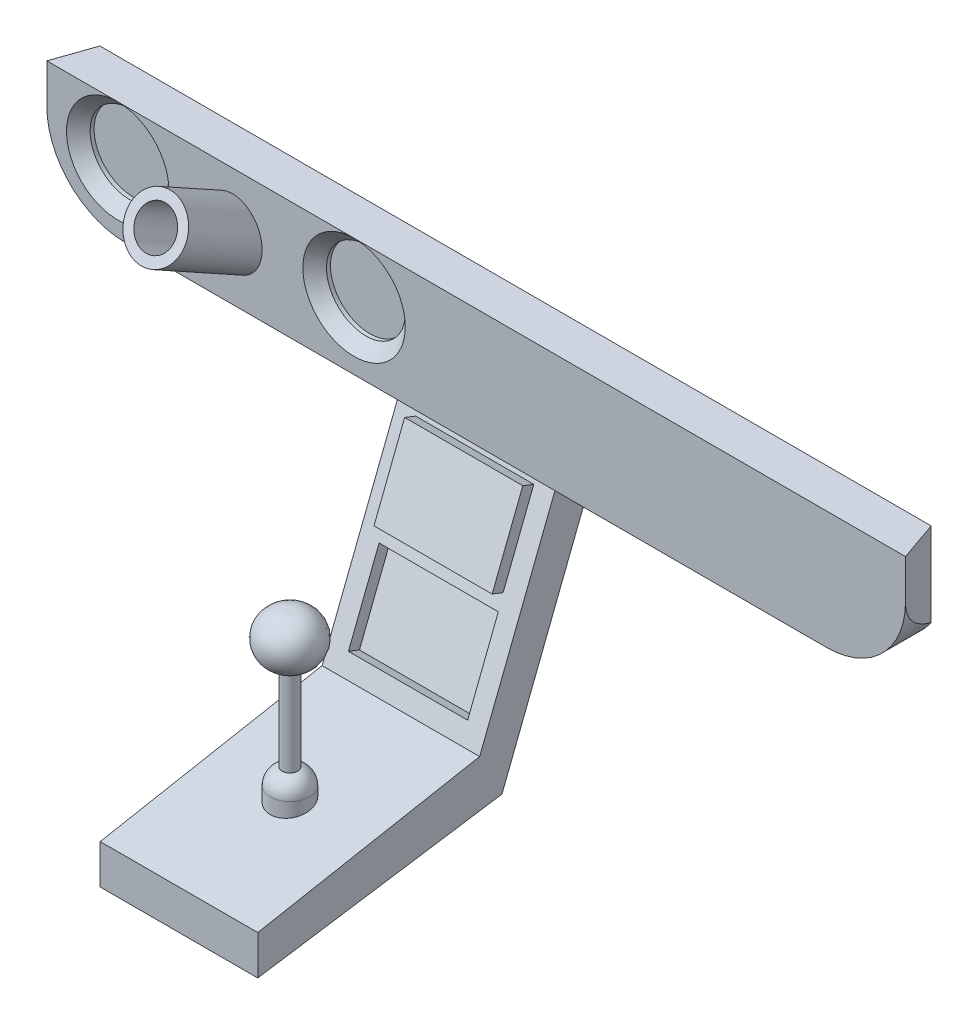
ISO-10303-21;
HEADER;
FILE_DESCRIPTION(('STEP AP214'),'2;1');
FILE_NAME('part.step','',(''),(''),'','','');
FILE_SCHEMA(('AUTOMOTIVE_DESIGN { 1 0 10303 214 1 1 1 1 }'));
ENDSEC;
DATA;
#1=APPLICATION_CONTEXT('core data for automotive mechanical design processes');
#2=APPLICATION_PROTOCOL_DEFINITION('international standard','automotive_design',2000,#1);
#3=PRODUCT_CONTEXT('',#1,'mechanical');
#4=PRODUCT('Part','Part','',(#3));
#5=PRODUCT_RELATED_PRODUCT_CATEGORY('part','',(#4));
#6=PRODUCT_DEFINITION_FORMATION('','',#4);
#7=PRODUCT_DEFINITION_CONTEXT('part definition',#1,'design');
#8=PRODUCT_DEFINITION('design','',#6,#7);
#9=PRODUCT_DEFINITION_SHAPE('','',#8);
#10=(LENGTH_UNIT() NAMED_UNIT(*) SI_UNIT(.MILLI.,.METRE.));
#11=(NAMED_UNIT(*) PLANE_ANGLE_UNIT() SI_UNIT($,.RADIAN.));
#12=(NAMED_UNIT(*) SI_UNIT($,.STERADIAN.) SOLID_ANGLE_UNIT());
#13=UNCERTAINTY_MEASURE_WITH_UNIT(LENGTH_MEASURE(1.E-05),#10,'distance_accuracy_value','');
#14=(GEOMETRIC_REPRESENTATION_CONTEXT(3) GLOBAL_UNCERTAINTY_ASSIGNED_CONTEXT((#13)) GLOBAL_UNIT_ASSIGNED_CONTEXT((#10,
#11,#12)) REPRESENTATION_CONTEXT('',''));
#15=CARTESIAN_POINT('',(0.,0.,0.));
#16=DIRECTION('',(0.,0.,1.));
#17=DIRECTION('',(1.,0.,0.));
#18=AXIS2_PLACEMENT_3D('',#15,#16,#17);
#19=CARTESIAN_POINT('',(-109.,-15.,5.));
#20=DIRECTION('',(0.,1.,0.));
#21=DIRECTION('',(0.,0.,1.));
#22=AXIS2_PLACEMENT_3D('',#19,#20,#21);
#23=PLANE('',#22);
#24=DIRECTION('',(0.,0.,1.));
#25=VECTOR('',#24,1.);
#26=CARTESIAN_POINT('',(20.,-15.,-5.));
#27=LINE('',#26,#25);
#28=CARTESIAN_POINT('',(20.,-15.,-5.));
#29=VERTEX_POINT('',#28);
#30=CARTESIAN_POINT('',(20.,-15.,5.));
#31=VERTEX_POINT('',#30);
#32=EDGE_CURVE('E337',#29,#31,#27,.T.);
#33=ORIENTED_EDGE('',*,*,#32,.F.);
#34=DIRECTION('',(1.,0.,0.));
#35=VECTOR('',#34,1.);
#36=CARTESIAN_POINT('',(-109.,-15.,-5.));
#37=LINE('',#36,#35);
#38=CARTESIAN_POINT('',(89.,-15.,-5.));
#39=VERTEX_POINT('',#38);
#40=EDGE_CURVE('E207',#29,#39,#37,.T.);
#41=ORIENTED_EDGE('',*,*,#40,.T.);
#42=DIRECTION('',(0.,0.,-1.));
#43=VECTOR('',#42,1.);
#44=CARTESIAN_POINT('',(89.,-15.,5.));
#45=LINE('',#44,#43);
#46=CARTESIAN_POINT('',(89.,-15.,5.));
#47=VERTEX_POINT('',#46);
#48=EDGE_CURVE('E229',#39,#47,#45,.F.);
#49=ORIENTED_EDGE('',*,*,#48,.T.);
#50=DIRECTION('',(1.,0.,0.));
#51=VECTOR('',#50,1.);
#52=CARTESIAN_POINT('',(-109.,-15.,5.));
#53=LINE('',#52,#51);
#54=EDGE_CURVE('E396',#31,#47,#53,.T.);
#55=ORIENTED_EDGE('',*,*,#54,.F.);
#56=EDGE_LOOP('',(#33,#41,#49,#55));
#57=FACE_BOUND('',#56,.T.);
#58=ADVANCED_FACE('F34',(#57),#23,.F.);
#59=CARTESIAN_POINT('',(-109.,15.,5.));
#60=DIRECTION('',(0.,-1.,0.));
#61=DIRECTION('',(0.,0.,-1.));
#62=AXIS2_PLACEMENT_3D('',#59,#60,#61);
#63=PLANE('',#62);
#64=DIRECTION('',(-1.,0.,0.));
#65=VECTOR('',#64,1.);
#66=CARTESIAN_POINT('',(-109.,15.,5.));
#67=LINE('',#66,#65);
#68=CARTESIAN_POINT('',(109.,15.,5.));
#69=VERTEX_POINT('',#68);
#70=CARTESIAN_POINT('',(-31.,15.,5.));
#71=VERTEX_POINT('',#70);
#72=EDGE_CURVE('E203',#69,#71,#67,.T.);
#73=ORIENTED_EDGE('',*,*,#72,.F.);
#74=DIRECTION('',(0.328667145466067,0.,0.94444582030479));
#75=VECTOR('',#74,1.);
#76=CARTESIAN_POINT('',(105.52,15.,-5.));
#77=LINE('',#76,#75);
#78=CARTESIAN_POINT('',(105.52,15.,-5.));
#79=VERTEX_POINT('',#78);
#80=EDGE_CURVE('E188',#79,#69,#77,.T.);
#81=ORIENTED_EDGE('',*,*,#80,.F.);
#82=DIRECTION('',(-1.,0.,0.));
#83=VECTOR('',#82,1.);
#84=CARTESIAN_POINT('',(-109.,15.,-5.));
#85=LINE('',#84,#83);
#86=CARTESIAN_POINT('',(-105.52,15.,-5.));
#87=VERTEX_POINT('',#86);
#88=EDGE_CURVE('E200',#79,#87,#85,.T.);
#89=ORIENTED_EDGE('',*,*,#88,.T.);
#90=DIRECTION('',(0.328667145466067,0.,-0.94444582030479));
#91=VECTOR('',#90,1.);
#92=CARTESIAN_POINT('',(-109.,15.,5.));
#93=LINE('',#92,#91);
#94=CARTESIAN_POINT('',(-109.,15.,5.));
#95=VERTEX_POINT('',#94);
#96=EDGE_CURVE('E194',#95,#87,#93,.T.);
#97=ORIENTED_EDGE('',*,*,#96,.F.);
#98=CARTESIAN_POINT('',(-91.,15.,5.));
#99=VERTEX_POINT('',#98);
#100=EDGE_CURVE('E393',#99,#95,#67,.T.);
#101=ORIENTED_EDGE('',*,*,#100,.F.);
#102=EDGE_CURVE('E395',#71,#99,#67,.T.);
#103=ORIENTED_EDGE('',*,*,#102,.F.);
#104=EDGE_LOOP('',(#73,#81,#89,#97,#101,#103));
#105=FACE_BOUND('',#104,.T.);
#106=ADVANCED_FACE('F198',(#105),#63,.F.);
#107=CARTESIAN_POINT('',(-89.,-15.,-5.));
#108=VERTEX_POINT('',#107);
#109=CARTESIAN_POINT('',(-20.,-15.,-5.));
#110=VERTEX_POINT('',#109);
#111=EDGE_CURVE('E211',#108,#110,#37,.T.);
#112=ORIENTED_EDGE('',*,*,#111,.T.);
#113=DIRECTION('',(0.,0.,1.));
#114=VECTOR('',#113,1.);
#115=CARTESIAN_POINT('',(-20.,-15.,-5.));
#116=LINE('',#115,#114);
#117=CARTESIAN_POINT('',(-20.,-15.,5.));
#118=VERTEX_POINT('',#117);
#119=EDGE_CURVE('E352',#110,#118,#116,.T.);
#120=ORIENTED_EDGE('',*,*,#119,.T.);
#121=CARTESIAN_POINT('',(-89.,-15.,5.));
#122=VERTEX_POINT('',#121);
#123=EDGE_CURVE('E217',#122,#118,#53,.T.);
#124=ORIENTED_EDGE('',*,*,#123,.F.);
#125=DIRECTION('',(0.,0.,-1.));
#126=VECTOR('',#125,1.);
#127=CARTESIAN_POINT('',(-89.,-15.,5.));
#128=LINE('',#127,#126);
#129=EDGE_CURVE('E226',#122,#108,#128,.T.);
#130=ORIENTED_EDGE('',*,*,#129,.T.);
#131=EDGE_LOOP('',(#112,#120,#124,#130));
#132=FACE_BOUND('',#131,.T.);
#133=ADVANCED_FACE('F464',(#132),#23,.F.);
#134=CARTESIAN_POINT('',(0.,0.,5.));
#135=DIRECTION('',(0.,0.,1.));
#136=DIRECTION('',(1.,0.,0.));
#137=AXIS2_PLACEMENT_3D('',#134,#135,#136);
#138=PLANE('',#137);
#139=CARTESIAN_POINT('',(-61.85,0.770482043936028,5.));
#140=DIRECTION('',(0.,0.,1.));
#141=DIRECTION('',(0.,1.,0.));
#142=AXIS2_PLACEMENT_3D('',#139,#140,#141);
#143=ELLIPSE('',#142,8.57438243843176,7.50000000000001);
#144=CARTESIAN_POINT('',(-61.85,9.34486448236779,5.));
#145=VERTEX_POINT('',#144);
#146=EDGE_CURVE('E249',#145,#145,#143,.T.);
#147=ORIENTED_EDGE('',*,*,#146,.F.);
#148=EDGE_LOOP('',(#147));
#149=FACE_BOUND('',#148,.T.);
#150=ORIENTED_EDGE('',*,*,#72,.T.);
#151=CARTESIAN_POINT('',(-31.,2.,5.));
#152=DIRECTION('',(0.,0.,1.));
#153=DIRECTION('',(1.,0.,0.));
#154=AXIS2_PLACEMENT_3D('',#151,#152,#153);
#155=CIRCLE('',#154,13.);
#156=EDGE_CURVE('E243',#71,#71,#155,.F.);
#157=ORIENTED_EDGE('',*,*,#156,.T.);
#158=ORIENTED_EDGE('',*,*,#102,.T.);
#159=CARTESIAN_POINT('',(-91.,2.,5.));
#160=DIRECTION('',(0.,0.,1.));
#161=DIRECTION('',(1.,0.,0.));
#162=AXIS2_PLACEMENT_3D('',#159,#160,#161);
#163=CIRCLE('',#162,13.);
#164=EDGE_CURVE('E240',#99,#99,#163,.F.);
#165=ORIENTED_EDGE('',*,*,#164,.T.);
#166=ORIENTED_EDGE('',*,*,#100,.T.);
#167=DIRECTION('',(0.,-1.,0.));
#168=VECTOR('',#167,1.);
#169=CARTESIAN_POINT('',(-109.,15.,5.));
#170=LINE('',#169,#168);
#171=CARTESIAN_POINT('',(-109.,5.,5.));
#172=VERTEX_POINT('',#171);
#173=EDGE_CURVE('E394',#95,#172,#170,.T.);
#174=ORIENTED_EDGE('',*,*,#173,.T.);
#175=CARTESIAN_POINT('',(-89.,5.,5.));
#176=DIRECTION('',(0.,0.,1.));
#177=DIRECTION('',(1.,0.,0.));
#178=AXIS2_PLACEMENT_3D('',#175,#176,#177);
#179=CIRCLE('',#178,20.);
#180=EDGE_CURVE('E232',#172,#122,#179,.T.);
#181=ORIENTED_EDGE('',*,*,#180,.T.);
#182=ORIENTED_EDGE('',*,*,#123,.T.);
#183=DIRECTION('',(-1.,0.,0.));
#184=VECTOR('',#183,1.);
#185=CARTESIAN_POINT('',(20.,-15.,5.));
#186=LINE('',#185,#184);
#187=EDGE_CURVE('E372',#31,#118,#186,.T.);
#188=ORIENTED_EDGE('',*,*,#187,.F.);
#189=ORIENTED_EDGE('',*,*,#54,.T.);
#190=CARTESIAN_POINT('',(89.,5.,5.));
#191=DIRECTION('',(0.,0.,1.));
#192=DIRECTION('',(1.,0.,0.));
#193=AXIS2_PLACEMENT_3D('',#190,#191,#192);
#194=CIRCLE('',#193,20.);
#195=CARTESIAN_POINT('',(109.,5.,5.));
#196=VERTEX_POINT('',#195);
#197=EDGE_CURVE('E234',#47,#196,#194,.T.);
#198=ORIENTED_EDGE('',*,*,#197,.T.);
#199=DIRECTION('',(0.,1.,0.));
#200=VECTOR('',#199,1.);
#201=CARTESIAN_POINT('',(109.,15.,5.));
#202=LINE('',#201,#200);
#203=EDGE_CURVE('E221',#196,#69,#202,.T.);
#204=ORIENTED_EDGE('',*,*,#203,.T.);
#205=EDGE_LOOP('',(#150,#157,#158,#165,#166,#174,#181,#182,#188,#189,#198,#204));
#206=FACE_BOUND('',#205,.T.);
#207=ADVANCED_FACE('F403',(#149,#206),#138,.T.);
#208=CARTESIAN_POINT('',(0.,0.,-5.));
#209=DIRECTION('',(0.,0.,1.));
#210=DIRECTION('',(1.,0.,0.));
#211=AXIS2_PLACEMENT_3D('',#208,#209,#210);
#212=PLANE('',#211);
#213=CARTESIAN_POINT('',(-61.85,-4.77048204393603,-5.));
#214=DIRECTION('',(0.,0.,1.));
#215=DIRECTION('',(0.,1.,0.));
#216=AXIS2_PLACEMENT_3D('',#213,#214,#215);
#217=ELLIPSE('',#216,8.57438243843176,7.50000000000001);
#218=CARTESIAN_POINT('',(-61.85,3.80390039449573,-5.));
#219=VERTEX_POINT('',#218);
#220=EDGE_CURVE('E250',#219,#219,#217,.T.);
#221=ORIENTED_EDGE('',*,*,#220,.T.);
#222=EDGE_LOOP('',(#221));
#223=FACE_BOUND('',#222,.T.);
#224=ORIENTED_EDGE('',*,*,#88,.F.);
#225=DIRECTION('',(0.,1.,0.));
#226=VECTOR('',#225,1.);
#227=CARTESIAN_POINT('',(105.52,-25.,-5.));
#228=LINE('',#227,#226);
#229=CARTESIAN_POINT('',(105.52,-6.27340232582869,-5.));
#230=VERTEX_POINT('',#229);
#231=EDGE_CURVE('E185',#230,#79,#228,.T.);
#232=ORIENTED_EDGE('',*,*,#231,.F.);
#233=CARTESIAN_POINT('',(89.,5.,-5.));
#234=DIRECTION('',(0.,0.,1.));
#235=DIRECTION('',(1.,0.,0.));
#236=AXIS2_PLACEMENT_3D('',#233,#234,#235);
#237=CIRCLE('',#236,20.);
#238=EDGE_CURVE('E224',#230,#39,#237,.F.);
#239=ORIENTED_EDGE('',*,*,#238,.T.);
#240=ORIENTED_EDGE('',*,*,#40,.F.);
#241=DIRECTION('',(-1.,0.,0.));
#242=VECTOR('',#241,1.);
#243=CARTESIAN_POINT('',(20.,-15.,-5.));
#244=LINE('',#243,#242);
#245=EDGE_CURVE('E375',#29,#110,#244,.T.);
#246=ORIENTED_EDGE('',*,*,#245,.T.);
#247=ORIENTED_EDGE('',*,*,#111,.F.);
#248=CARTESIAN_POINT('',(-89.,5.,-5.));
#249=DIRECTION('',(0.,0.,1.));
#250=DIRECTION('',(1.,0.,0.));
#251=AXIS2_PLACEMENT_3D('',#248,#249,#250);
#252=CIRCLE('',#251,20.);
#253=CARTESIAN_POINT('',(-105.52,-6.27340232582869,-5.));
#254=VERTEX_POINT('',#253);
#255=EDGE_CURVE('E222',#108,#254,#252,.F.);
#256=ORIENTED_EDGE('',*,*,#255,.T.);
#257=DIRECTION('',(0.,1.,0.));
#258=VECTOR('',#257,1.);
#259=CARTESIAN_POINT('',(-105.52,-25.,-5.));
#260=LINE('',#259,#258);
#261=EDGE_CURVE('E49',#254,#87,#260,.T.);
#262=ORIENTED_EDGE('',*,*,#261,.T.);
#263=EDGE_LOOP('',(#224,#232,#239,#240,#246,#247,#256,#262));
#264=FACE_BOUND('',#263,.T.);
#265=ADVANCED_FACE('F205',(#223,#264),#212,.F.);
#266=CARTESIAN_POINT('',(89.,5.,5.));
#267=DIRECTION('',(0.,0.,-1.));
#268=DIRECTION('',(-1.,0.,0.));
#269=AXIS2_PLACEMENT_3D('',#266,#267,#268);
#270=CYLINDRICAL_SURFACE('',#269,20.);
#271=CARTESIAN_POINT('',(89.,5.,-52.4712643678162));
#272=DIRECTION('',(-0.94444582030479,0.,0.328667145466067));
#273=DIRECTION('',(-0.328667145466067,0.,-0.94444582030479));
#274=AXIS2_PLACEMENT_3D('',#271,#272,#273);
#275=ELLIPSE('',#274,60.8518383291369,20.);
#276=EDGE_CURVE('E11',#196,#230,#275,.F.);
#277=ORIENTED_EDGE('',*,*,#276,.F.);
#278=ORIENTED_EDGE('',*,*,#197,.F.);
#279=ORIENTED_EDGE('',*,*,#48,.F.);
#280=ORIENTED_EDGE('',*,*,#238,.F.);
#281=EDGE_LOOP('',(#277,#278,#279,#280));
#282=FACE_BOUND('',#281,.T.);
#283=ADVANCED_FACE('F437',(#282),#270,.T.);
#284=CARTESIAN_POINT('',(-89.,5.,5.));
#285=DIRECTION('',(0.,0.,-1.));
#286=DIRECTION('',(-1.,0.,0.));
#287=AXIS2_PLACEMENT_3D('',#284,#285,#286);
#288=CYLINDRICAL_SURFACE('',#287,20.);
#289=CARTESIAN_POINT('',(-89.,5.,-52.4712643678162));
#290=DIRECTION('',(0.94444582030479,0.,0.328667145466067));
#291=DIRECTION('',(0.328667145466067,0.,-0.94444582030479));
#292=AXIS2_PLACEMENT_3D('',#289,#290,#291);
#293=ELLIPSE('',#292,60.8518383291369,20.);
#294=EDGE_CURVE('E42',#254,#172,#293,.F.);
#295=ORIENTED_EDGE('',*,*,#294,.F.);
#296=ORIENTED_EDGE('',*,*,#255,.F.);
#297=ORIENTED_EDGE('',*,*,#129,.F.);
#298=ORIENTED_EDGE('',*,*,#180,.F.);
#299=EDGE_LOOP('',(#295,#296,#297,#298));
#300=FACE_BOUND('',#299,.T.);
#301=ADVANCED_FACE('F533',(#300),#288,.T.);
#302=CARTESIAN_POINT('',(-31.,2.,1.));
#303=DIRECTION('',(0.,0.,1.));
#304=DIRECTION('',(1.,0.,0.));
#305=AXIS2_PLACEMENT_3D('',#302,#303,#304);
#306=CYLINDRICAL_SURFACE('',#305,10.);
#307=CARTESIAN_POINT('',(-31.,2.,1.99999999999998));
#308=DIRECTION('',(0.,0.,1.));
#309=DIRECTION('',(1.,0.,0.));
#310=AXIS2_PLACEMENT_3D('',#307,#308,#309);
#311=CIRCLE('',#310,10.);
#312=CARTESIAN_POINT('',(-21.,2.,1.99999999999998));
#313=VERTEX_POINT('',#312);
#314=EDGE_CURVE('E237',#313,#313,#311,.T.);
#315=ORIENTED_EDGE('',*,*,#314,.T.);
#316=EDGE_LOOP('',(#315));
#317=FACE_BOUND('',#316,.T.);
#318=CARTESIAN_POINT('',(-31.,2.,1.));
#319=DIRECTION('',(0.,0.,1.));
#320=DIRECTION('',(1.,0.,0.));
#321=AXIS2_PLACEMENT_3D('',#318,#319,#320);
#322=CIRCLE('',#321,10.);
#323=CARTESIAN_POINT('',(-21.,2.,1.));
#324=VERTEX_POINT('',#323);
#325=EDGE_CURVE('E214',#324,#324,#322,.T.);
#326=ORIENTED_EDGE('',*,*,#325,.F.);
#327=EDGE_LOOP('',(#326));
#328=FACE_BOUND('',#327,.T.);
#329=ADVANCED_FACE('F536',(#317,#328),#306,.F.);
#330=CARTESIAN_POINT('',(-31.,2.,1.));
#331=DIRECTION('',(0.,0.,1.));
#332=DIRECTION('',(1.,0.,0.));
#333=AXIS2_PLACEMENT_3D('',#330,#331,#332);
#334=PLANE('',#333);
#335=ORIENTED_EDGE('',*,*,#325,.T.);
#336=EDGE_LOOP('',(#335));
#337=FACE_BOUND('',#336,.T.);
#338=ADVANCED_FACE('F452',(#337),#334,.T.);
#339=CARTESIAN_POINT('',(-91.,2.,1.));
#340=DIRECTION('',(0.,0.,1.));
#341=DIRECTION('',(1.,0.,0.));
#342=AXIS2_PLACEMENT_3D('',#339,#340,#341);
#343=CYLINDRICAL_SURFACE('',#342,9.99999999999999);
#344=CARTESIAN_POINT('',(-91.,2.,1.99999999999998));
#345=DIRECTION('',(0.,0.,1.));
#346=DIRECTION('',(1.,0.,0.));
#347=AXIS2_PLACEMENT_3D('',#344,#345,#346);
#348=CIRCLE('',#347,9.99999999999999);
#349=CARTESIAN_POINT('',(-81.,2.,1.99999999999998));
#350=VERTEX_POINT('',#349);
#351=EDGE_CURVE('E246',#350,#350,#348,.T.);
#352=ORIENTED_EDGE('',*,*,#351,.T.);
#353=EDGE_LOOP('',(#352));
#354=FACE_BOUND('',#353,.T.);
#355=CARTESIAN_POINT('',(-91.,2.,1.));
#356=DIRECTION('',(0.,0.,1.));
#357=DIRECTION('',(1.,0.,0.));
#358=AXIS2_PLACEMENT_3D('',#355,#356,#357);
#359=CIRCLE('',#358,9.99999999999999);
#360=CARTESIAN_POINT('',(-81.,2.,1.));
#361=VERTEX_POINT('',#360);
#362=EDGE_CURVE('E208',#361,#361,#359,.T.);
#363=ORIENTED_EDGE('',*,*,#362,.F.);
#364=EDGE_LOOP('',(#363));
#365=FACE_BOUND('',#364,.T.);
#366=ADVANCED_FACE('F448',(#354,#365),#343,.F.);
#367=CARTESIAN_POINT('',(-91.,2.,1.));
#368=DIRECTION('',(0.,0.,1.));
#369=DIRECTION('',(1.,0.,0.));
#370=AXIS2_PLACEMENT_3D('',#367,#368,#369);
#371=PLANE('',#370);
#372=ORIENTED_EDGE('',*,*,#362,.T.);
#373=EDGE_LOOP('',(#372));
#374=FACE_BOUND('',#373,.T.);
#375=ADVANCED_FACE('F451',(#374),#371,.T.);
#376=CARTESIAN_POINT('',(-31.,2.,1.99999999999998));
#377=DIRECTION('',(0.,0.,1.));
#378=DIRECTION('',(1.,0.,0.));
#379=AXIS2_PLACEMENT_3D('',#376,#377,#378);
#380=CONICAL_SURFACE('',#379,10.,0.785398163397452);
#381=ORIENTED_EDGE('',*,*,#156,.F.);
#382=EDGE_LOOP('',(#381));
#383=FACE_BOUND('',#382,.T.);
#384=ORIENTED_EDGE('',*,*,#314,.F.);
#385=EDGE_LOOP('',(#384));
#386=FACE_BOUND('',#385,.T.);
#387=ADVANCED_FACE('F445',(#383,#386),#380,.F.);
#388=CARTESIAN_POINT('',(-91.,2.,1.99999999999998));
#389=DIRECTION('',(0.,0.,1.));
#390=DIRECTION('',(1.,0.,0.));
#391=AXIS2_PLACEMENT_3D('',#388,#389,#390);
#392=CONICAL_SURFACE('',#391,9.99999999999999,0.785398163397452);
#393=ORIENTED_EDGE('',*,*,#164,.F.);
#394=EDGE_LOOP('',(#393));
#395=FACE_BOUND('',#394,.T.);
#396=ORIENTED_EDGE('',*,*,#351,.F.);
#397=EDGE_LOOP('',(#396));
#398=FACE_BOUND('',#397,.T.);
#399=ADVANCED_FACE('F36',(#395,#398),#392,.F.);
#400=CARTESIAN_POINT('',(-61.8499999999999,-13.3542745028374,-5.01698264114393));
#401=DIRECTION('',(0.,-0.484667332690623,-0.874698563290553));
#402=DIRECTION('',(0.,0.874698563290553,-0.484667332690623));
#403=AXIS2_PLACEMENT_3D('',#400,#401,#402);
#404=PLANE('',#403);
#405=CARTESIAN_POINT('',(-61.85,-6.79403527815822,-8.65198763632361));
#406=DIRECTION('',(0.,-0.484667332690623,-0.874698563290553));
#407=DIRECTION('',(0.,0.874698563290553,-0.484667332690623));
#408=AXIS2_PLACEMENT_3D('',#405,#406,#407);
#409=CIRCLE('',#408,5.);
#410=CARTESIAN_POINT('',(-61.85,-2.42054246170546,-11.0753242997767));
#411=VERTEX_POINT('',#410);
#412=EDGE_CURVE('E380',#411,#411,#409,.T.);
#413=ORIENTED_EDGE('',*,*,#412,.F.);
#414=EDGE_LOOP('',(#413));
#415=FACE_BOUND('',#414,.T.);
#416=CARTESIAN_POINT('',(-61.85,-6.79403527815822,-8.65198763632362));
#417=DIRECTION('',(0.,0.484667332690623,0.874698563290553));
#418=DIRECTION('',(0.,-0.874698563290553,0.484667332690623));
#419=AXIS2_PLACEMENT_3D('',#416,#417,#418);
#420=CIRCLE('',#419,7.50000000000001);
#421=CARTESIAN_POINT('',(-61.85,-13.3542745028374,-5.01698264114394));
#422=VERTEX_POINT('',#421);
#423=EDGE_CURVE('E383',#422,#422,#420,.T.);
#424=ORIENTED_EDGE('',*,*,#423,.F.);
#425=EDGE_LOOP('',(#424));
#426=FACE_BOUND('',#425,.T.);
#427=ADVANCED_FACE('F444',(#415,#426),#404,.T.);
#428=CARTESIAN_POINT('',(-61.85,11.5706853153375,24.4915597721355));
#429=DIRECTION('',(0.,0.484667332690623,0.874698563290553));
#430=DIRECTION('',(0.,-0.874698563290553,0.484667332690623));
#431=AXIS2_PLACEMENT_3D('',#428,#429,#430);
#432=CYLINDRICAL_SURFACE('',#431,7.50000000000001);
#433=ORIENTED_EDGE('',*,*,#423,.T.);
#434=EDGE_LOOP('',(#433));
#435=FACE_BOUND('',#434,.T.);
#436=ORIENTED_EDGE('',*,*,#220,.F.);
#437=EDGE_LOOP('',(#436));
#438=FACE_BOUND('',#437,.T.);
#439=ADVANCED_FACE('F507',(#435,#438),#432,.T.);
#440=CARTESIAN_POINT('',(-61.8499999999999,5.01044609065831,28.1265647673151));
#441=DIRECTION('',(0.,-0.484667332690623,-0.874698563290553));
#442=DIRECTION('',(0.,0.874698563290553,-0.484667332690623));
#443=AXIS2_PLACEMENT_3D('',#440,#441,#442);
#444=PLANE('',#443);
#445=CARTESIAN_POINT('',(-61.85,11.5706853153375,24.4915597721355));
#446=DIRECTION('',(0.,0.484667332690624,0.874698563290553));
#447=DIRECTION('',(0.,-0.874698563290553,0.484667332690624));
#448=AXIS2_PLACEMENT_3D('',#445,#446,#447);
#449=CIRCLE('',#448,5.);
#450=CARTESIAN_POINT('',(-61.85,7.1971924988847,26.9148964355886));
#451=VERTEX_POINT('',#450);
#452=EDGE_CURVE('E377',#451,#451,#449,.T.);
#453=ORIENTED_EDGE('',*,*,#452,.F.);
#454=EDGE_LOOP('',(#453));
#455=FACE_BOUND('',#454,.T.);
#456=CARTESIAN_POINT('',(-61.85,11.5706853153375,24.4915597721355));
#457=DIRECTION('',(0.,0.484667332690623,0.874698563290553));
#458=DIRECTION('',(0.,-0.874698563290553,0.484667332690623));
#459=AXIS2_PLACEMENT_3D('',#456,#457,#458);
#460=CIRCLE('',#459,7.5);
#461=CARTESIAN_POINT('',(-61.85,5.01044609065831,28.1265647673151));
#462=VERTEX_POINT('',#461);
#463=EDGE_CURVE('E253',#462,#462,#460,.T.);
#464=ORIENTED_EDGE('',*,*,#463,.T.);
#465=EDGE_LOOP('',(#464));
#466=FACE_BOUND('',#465,.T.);
#467=ADVANCED_FACE('F510',(#455,#466),#444,.F.);
#468=ORIENTED_EDGE('',*,*,#146,.T.);
#469=EDGE_LOOP('',(#468));
#470=FACE_BOUND('',#469,.T.);
#471=ORIENTED_EDGE('',*,*,#463,.F.);
#472=EDGE_LOOP('',(#471));
#473=FACE_BOUND('',#472,.T.);
#474=ADVANCED_FACE('F503',(#470,#473),#432,.T.);
#475=CARTESIAN_POINT('',(-61.85,-10.2626523692816,-14.911939940861));
#476=DIRECTION('',(0.,0.484667332690624,0.874698563290552));
#477=DIRECTION('',(0.,-0.874698563290552,0.484667332690624));
#478=AXIS2_PLACEMENT_3D('',#475,#476,#477);
#479=CYLINDRICAL_SURFACE('',#478,5.);
#480=ORIENTED_EDGE('',*,*,#412,.T.);
#481=EDGE_LOOP('',(#480));
#482=FACE_BOUND('',#481,.T.);
#483=ORIENTED_EDGE('',*,*,#452,.T.);
#484=EDGE_LOOP('',(#483));
#485=FACE_BOUND('',#484,.T.);
#486=ADVANCED_FACE('F500',(#482,#485),#479,.F.);
#487=CARTESIAN_POINT('',(20.,-15.,-5.));
#488=DIRECTION('',(0.,0.363980164873198,0.93140669934185));
#489=DIRECTION('',(0.,-0.93140669934185,0.363980164873198));
#490=AXIS2_PLACEMENT_3D('',#487,#488,#489);
#491=PLANE('',#490);
#492=DIRECTION('',(0.,0.93140669934185,-0.363980164873198));
#493=VECTOR('',#492,1.);
#494=CARTESIAN_POINT('',(-20.,-15.,-5.));
#495=LINE('',#494,#493);
#496=CARTESIAN_POINT('',(-20.,-75.,18.447125630322));
#497=VERTEX_POINT('',#496);
#498=EDGE_CURVE('E333',#497,#110,#495,.T.);
#499=ORIENTED_EDGE('',*,*,#498,.T.);
#500=ORIENTED_EDGE('',*,*,#245,.F.);
#501=DIRECTION('',(0.,0.93140669934185,-0.363980164873198));
#502=VECTOR('',#501,1.);
#503=CARTESIAN_POINT('',(20.,-15.,-5.));
#504=LINE('',#503,#502);
#505=CARTESIAN_POINT('',(20.,-75.,18.447125630322));
#506=VERTEX_POINT('',#505);
#507=EDGE_CURVE('E334',#506,#29,#504,.T.);
#508=ORIENTED_EDGE('',*,*,#507,.F.);
#509=DIRECTION('',(-1.,0.,0.));
#510=VECTOR('',#509,1.);
#511=CARTESIAN_POINT('',(20.,-75.,18.447125630322));
#512=LINE('',#511,#510);
#513=EDGE_CURVE('E349',#506,#497,#512,.T.);
#514=ORIENTED_EDGE('',*,*,#513,.T.);
#515=EDGE_LOOP('',(#499,#500,#508,#514));
#516=FACE_BOUND('',#515,.T.);
#517=ADVANCED_FACE('F478',(#516),#491,.F.);
#518=CARTESIAN_POINT('',(20.,-15.,5.));
#519=DIRECTION('',(0.,-0.363980164873198,-0.93140669934185));
#520=DIRECTION('',(0.,0.93140669934185,-0.363980164873198));
#521=AXIS2_PLACEMENT_3D('',#518,#519,#520);
#522=PLANE('',#521);
#523=DIRECTION('',(-1.,0.,0.));
#524=VECTOR('',#523,1.);
#525=CARTESIAN_POINT('',(-15.1312420763939,-39.3259997440696,14.506246201373));
#526=LINE('',#525,#524);
#527=CARTESIAN_POINT('',(15.1312420763939,-39.3259997440696,14.506246201373));
#528=VERTEX_POINT('',#527);
#529=CARTESIAN_POINT('',(-15.1312420763939,-39.3259997440696,14.506246201373));
#530=VERTEX_POINT('',#529);
#531=EDGE_CURVE('E285',#528,#530,#526,.T.);
#532=ORIENTED_EDGE('',*,*,#531,.F.);
#533=DIRECTION('',(0.,0.93140669934185,-0.363980164873198));
#534=VECTOR('',#533,1.);
#535=CARTESIAN_POINT('',(15.1312420763939,-39.3259997440696,14.506246201373));
#536=LINE('',#535,#534);
#537=CARTESIAN_POINT('',(15.1312420763939,-59.2581031099852,22.2954217296594));
#538=VERTEX_POINT('',#537);
#539=EDGE_CURVE('E283',#538,#528,#536,.T.);
#540=ORIENTED_EDGE('',*,*,#539,.F.);
#541=DIRECTION('',(1.,0.,0.));
#542=VECTOR('',#541,1.);
#543=CARTESIAN_POINT('',(-15.1312420763939,-59.2581031099852,22.2954217296594));
#544=LINE('',#543,#542);
#545=CARTESIAN_POINT('',(-15.1312420763939,-59.2581031099852,22.2954217296594));
#546=VERTEX_POINT('',#545);
#547=EDGE_CURVE('E273',#546,#538,#544,.T.);
#548=ORIENTED_EDGE('',*,*,#547,.F.);
#549=DIRECTION('',(0.,-0.93140669934185,0.363980164873198));
#550=VECTOR('',#549,1.);
#551=CARTESIAN_POINT('',(-15.1312420763939,-39.3259997440696,14.506246201373));
#552=LINE('',#551,#550);
#553=EDGE_CURVE('E288',#530,#546,#552,.T.);
#554=ORIENTED_EDGE('',*,*,#553,.F.);
#555=EDGE_LOOP('',(#532,#540,#548,#554));
#556=FACE_BOUND('',#555,.T.);
#557=DIRECTION('',(1.,0.,0.));
#558=VECTOR('',#557,1.);
#559=CARTESIAN_POINT('',(0.,-15.9304752926425,5.36361618470833));
#560=LINE('',#559,#558);
#561=CARTESIAN_POINT('',(-15.,-15.9304752926425,5.36361618470833));
#562=VERTEX_POINT('',#561);
#563=CARTESIAN_POINT('',(15.,-15.9304752926425,5.36361618470833));
#564=VERTEX_POINT('',#563);
#565=EDGE_CURVE('E315',#562,#564,#560,.T.);
#566=ORIENTED_EDGE('',*,*,#565,.T.);
#567=DIRECTION('',(0.,-0.93140669934185,0.363980164873198));
#568=VECTOR('',#567,1.);
#569=CARTESIAN_POINT('',(15.,-0.292155586364565,-0.74761126196232));
#570=LINE('',#569,#568);
#571=CARTESIAN_POINT('',(15.,-35.8625786585581,13.1527917129948));
#572=VERTEX_POINT('',#571);
#573=EDGE_CURVE('E295',#564,#572,#570,.T.);
#574=ORIENTED_EDGE('',*,*,#573,.T.);
#575=DIRECTION('',(1.,0.,0.));
#576=VECTOR('',#575,1.);
#577=CARTESIAN_POINT('',(0.,-35.8625786585581,13.1527917129948));
#578=LINE('',#577,#576);
#579=CARTESIAN_POINT('',(-15.,-35.8625786585581,13.1527917129948));
#580=VERTEX_POINT('',#579);
#581=EDGE_CURVE('E306',#580,#572,#578,.T.);
#582=ORIENTED_EDGE('',*,*,#581,.F.);
#583=DIRECTION('',(0.,-0.93140669934185,0.363980164873198));
#584=VECTOR('',#583,1.);
#585=CARTESIAN_POINT('',(-15.,-0.292155586364568,-0.747611261962318));
#586=LINE('',#585,#584);
#587=EDGE_CURVE('E317',#562,#580,#586,.T.);
#588=ORIENTED_EDGE('',*,*,#587,.F.);
#589=EDGE_LOOP('',(#566,#574,#582,#588));
#590=FACE_BOUND('',#589,.T.);
#591=DIRECTION('',(0.,-0.93140669934185,0.363980164873198));
#592=VECTOR('',#591,1.);
#593=CARTESIAN_POINT('',(-20.,-15.,5.));
#594=LINE('',#593,#592);
#595=CARTESIAN_POINT('',(-20.,-63.9151366066944,24.1153225540254));
#596=VERTEX_POINT('',#595);
#597=EDGE_CURVE('E354',#118,#596,#594,.T.);
#598=ORIENTED_EDGE('',*,*,#597,.T.);
#599=DIRECTION('',(-1.,0.,0.));
#600=VECTOR('',#599,1.);
#601=CARTESIAN_POINT('',(20.,-63.9151366066944,24.1153225540254));
#602=LINE('',#601,#600);
#603=CARTESIAN_POINT('',(20.,-63.9151366066944,24.1153225540254));
#604=VERTEX_POINT('',#603);
#605=EDGE_CURVE('E369',#604,#596,#602,.T.);
#606=ORIENTED_EDGE('',*,*,#605,.F.);
#607=DIRECTION('',(0.,-0.93140669934185,0.363980164873198));
#608=VECTOR('',#607,1.);
#609=CARTESIAN_POINT('',(20.,-15.,5.));
#610=LINE('',#609,#608);
#611=EDGE_CURVE('E341',#31,#604,#610,.T.);
#612=ORIENTED_EDGE('',*,*,#611,.F.);
#613=ORIENTED_EDGE('',*,*,#187,.T.);
#614=EDGE_LOOP('',(#598,#606,#612,#613));
#615=FACE_BOUND('',#614,.T.);
#616=ADVANCED_FACE('F409',(#556,#590,#615),#522,.F.);
#617=CARTESIAN_POINT('',(20.,-63.9151366066944,24.1153225540254));
#618=DIRECTION('',(0.,-0.982997320387424,-0.183619901184878));
#619=DIRECTION('',(0.,0.183619901184878,-0.982997320387424));
#620=AXIS2_PLACEMENT_3D('',#617,#618,#619);
#621=PLANE('',#620);
#622=CARTESIAN_POINT('',(0.,-69.1748451369172,52.272833574697));
#623=DIRECTION('',(0.,-0.982997320387424,-0.183619901184878));
#624=DIRECTION('',(0.,0.183619901184878,-0.982997320387424));
#625=AXIS2_PLACEMENT_3D('',#622,#623,#624);
#626=ELLIPSE('',#625,5.086483855347,5.);
#627=CARTESIAN_POINT('',(0.,-68.2408654740199,47.272833574697));
#628=VERTEX_POINT('',#627);
#629=EDGE_CURVE('E259',#628,#628,#626,.F.);
#630=ORIENTED_EDGE('',*,*,#629,.F.);
#631=EDGE_LOOP('',(#630));
#632=FACE_BOUND('',#631,.T.);
#633=DIRECTION('',(0.,-0.183619901184878,0.982997320387424));
#634=VECTOR('',#633,1.);
#635=CARTESIAN_POINT('',(-20.,-63.9151366066944,24.1153225540254));
#636=LINE('',#635,#634);
#637=CARTESIAN_POINT('',(-20.,-74.4376882962137,80.447125630322));
#638=VERTEX_POINT('',#637);
#639=EDGE_CURVE('E356',#596,#638,#636,.T.);
#640=ORIENTED_EDGE('',*,*,#639,.T.);
#641=DIRECTION('',(-1.,0.,0.));
#642=VECTOR('',#641,1.);
#643=CARTESIAN_POINT('',(20.,-74.4376882962137,80.447125630322));
#644=LINE('',#643,#642);
#645=CARTESIAN_POINT('',(20.,-74.4376882962137,80.447125630322));
#646=VERTEX_POINT('',#645);
#647=EDGE_CURVE('E366',#646,#638,#644,.T.);
#648=ORIENTED_EDGE('',*,*,#647,.F.);
#649=DIRECTION('',(0.,-0.183619901184878,0.982997320387424));
#650=VECTOR('',#649,1.);
#651=CARTESIAN_POINT('',(20.,-63.9151366066944,24.1153225540254));
#652=LINE('',#651,#650);
#653=EDGE_CURVE('E343',#604,#646,#652,.T.);
#654=ORIENTED_EDGE('',*,*,#653,.F.);
#655=ORIENTED_EDGE('',*,*,#605,.T.);
#656=EDGE_LOOP('',(#640,#648,#654,#655));
#657=FACE_BOUND('',#656,.T.);
#658=ADVANCED_FACE('F420',(#632,#657),#621,.F.);
#659=CARTESIAN_POINT('',(20.,-74.4376882962137,80.447125630322));
#660=DIRECTION('',(0.,0.,-1.));
#661=DIRECTION('',(-1.,0.,0.));
#662=AXIS2_PLACEMENT_3D('',#659,#660,#661);
#663=PLANE('',#662);
#664=DIRECTION('',(0.,-1.,0.));
#665=VECTOR('',#664,1.);
#666=CARTESIAN_POINT('',(-20.,-74.4376882962137,80.447125630322));
#667=LINE('',#666,#665);
#668=CARTESIAN_POINT('',(-20.,-84.4376882962137,80.447125630322));
#669=VERTEX_POINT('',#668);
#670=EDGE_CURVE('E358',#638,#669,#667,.T.);
#671=ORIENTED_EDGE('',*,*,#670,.T.);
#672=DIRECTION('',(-1.,0.,0.));
#673=VECTOR('',#672,1.);
#674=CARTESIAN_POINT('',(20.,-84.4376882962137,80.447125630322));
#675=LINE('',#674,#673);
#676=CARTESIAN_POINT('',(20.,-84.4376882962137,80.447125630322));
#677=VERTEX_POINT('',#676);
#678=EDGE_CURVE('E363',#677,#669,#675,.T.);
#679=ORIENTED_EDGE('',*,*,#678,.F.);
#680=DIRECTION('',(0.,-1.,0.));
#681=VECTOR('',#680,1.);
#682=CARTESIAN_POINT('',(20.,-74.4376882962137,80.447125630322));
#683=LINE('',#682,#681);
#684=EDGE_CURVE('E345',#646,#677,#683,.T.);
#685=ORIENTED_EDGE('',*,*,#684,.F.);
#686=ORIENTED_EDGE('',*,*,#647,.T.);
#687=EDGE_LOOP('',(#671,#679,#685,#686));
#688=FACE_BOUND('',#687,.T.);
#689=ADVANCED_FACE('F424',(#688),#663,.F.);
#690=CARTESIAN_POINT('',(20.,-75.,18.447125630322));
#691=DIRECTION('',(0.,0.988611945321656,0.150487280417085));
#692=DIRECTION('',(0.,-0.150487280417085,0.988611945321656));
#693=AXIS2_PLACEMENT_3D('',#690,#691,#692);
#694=PLANE('',#693);
#695=CARTESIAN_POINT('',(0.,-80.1489756125447,52.272833574697));
#696=DIRECTION('',(0.,0.988611945321656,0.150487280417085));
#697=DIRECTION('',(0.,0.150487280417085,-0.988611945321656));
#698=AXIS2_PLACEMENT_3D('',#695,#696,#697);
#699=ELLIPSE('',#698,7.58639427279,7.5);
#700=CARTESIAN_POINT('',(2.82944338324049,-81.2062719318811,59.218641673186));
#701=VERTEX_POINT('',#700);
#702=CARTESIAN_POINT('',(-2.82944338324049,-81.2062719318811,59.218641673186));
#703=VERTEX_POINT('',#702);
#704=EDGE_CURVE('E258',#701,#703,#699,.F.);
#705=ORIENTED_EDGE('',*,*,#704,.F.);
#706=DIRECTION('',(1.,0.,0.));
#707=VECTOR('',#706,1.);
#708=CARTESIAN_POINT('',(20.,-81.2062719318811,59.218641673186));
#709=LINE('',#708,#707);
#710=EDGE_CURVE('E56',#703,#701,#709,.T.);
#711=ORIENTED_EDGE('',*,*,#710,.F.);
#712=EDGE_LOOP('',(#705,#711));
#713=FACE_BOUND('',#712,.T.);
#714=CARTESIAN_POINT('',(0.,-80.1489756125447,52.272833574697));
#715=DIRECTION('',(0.,0.988611945321656,0.150487280417085));
#716=DIRECTION('',(0.,0.150487280417085,-0.988611945321656));
#717=AXIS2_PLACEMENT_3D('',#714,#715,#716);
#718=ELLIPSE('',#717,5.05759618186,5.);
#719=CARTESIAN_POINT('',(0.,-79.3878717176888,47.272833574697));
#720=VERTEX_POINT('',#719);
#721=EDGE_CURVE('E254',#720,#720,#718,.F.);
#722=ORIENTED_EDGE('',*,*,#721,.F.);
#723=EDGE_LOOP('',(#722));
#724=FACE_BOUND('',#723,.T.);
#725=DIRECTION('',(0.,0.150487280417085,-0.988611945321656));
#726=VECTOR('',#725,1.);
#727=CARTESIAN_POINT('',(-20.,-75.,18.447125630322));
#728=LINE('',#727,#726);
#729=EDGE_CURVE('E338',#669,#497,#728,.T.);
#730=ORIENTED_EDGE('',*,*,#729,.T.);
#731=ORIENTED_EDGE('',*,*,#513,.F.);
#732=DIRECTION('',(0.,0.150487280417085,-0.988611945321656));
#733=VECTOR('',#732,1.);
#734=CARTESIAN_POINT('',(20.,-75.,18.447125630322));
#735=LINE('',#734,#733);
#736=EDGE_CURVE('E347',#677,#506,#735,.T.);
#737=ORIENTED_EDGE('',*,*,#736,.F.);
#738=ORIENTED_EDGE('',*,*,#678,.T.);
#739=EDGE_LOOP('',(#730,#731,#737,#738));
#740=FACE_BOUND('',#739,.T.);
#741=ADVANCED_FACE('F480',(#713,#724,#740),#694,.F.);
#742=CARTESIAN_POINT('',(20.,0.,0.));
#743=DIRECTION('',(-1.,0.,0.));
#744=DIRECTION('',(0.,0.,1.));
#745=AXIS2_PLACEMENT_3D('',#742,#743,#744);
#746=PLANE('',#745);
#747=ORIENTED_EDGE('',*,*,#507,.T.);
#748=ORIENTED_EDGE('',*,*,#32,.T.);
#749=ORIENTED_EDGE('',*,*,#611,.T.);
#750=ORIENTED_EDGE('',*,*,#653,.T.);
#751=ORIENTED_EDGE('',*,*,#684,.T.);
#752=ORIENTED_EDGE('',*,*,#736,.T.);
#753=EDGE_LOOP('',(#747,#748,#749,#750,#751,#752));
#754=FACE_BOUND('',#753,.T.);
#755=ADVANCED_FACE('F428',(#754),#746,.F.);
#756=CARTESIAN_POINT('',(-20.,0.,0.));
#757=DIRECTION('',(-1.,0.,0.));
#758=DIRECTION('',(0.,0.,1.));
#759=AXIS2_PLACEMENT_3D('',#756,#757,#758);
#760=PLANE('',#759);
#761=ORIENTED_EDGE('',*,*,#498,.F.);
#762=ORIENTED_EDGE('',*,*,#729,.F.);
#763=ORIENTED_EDGE('',*,*,#670,.F.);
#764=ORIENTED_EDGE('',*,*,#639,.F.);
#765=ORIENTED_EDGE('',*,*,#597,.F.);
#766=ORIENTED_EDGE('',*,*,#119,.F.);
#767=EDGE_LOOP('',(#761,#762,#763,#764,#765,#766));
#768=FACE_BOUND('',#767,.T.);
#769=ADVANCED_FACE('F415',(#768),#760,.T.);
#770=CARTESIAN_POINT('',(15.,0.79978490825503,2.04660883606323));
#771=DIRECTION('',(1.,0.,0.));
#772=DIRECTION('',(0.,1.,0.));
#773=AXIS2_PLACEMENT_3D('',#770,#771,#772);
#774=PLANE('',#773);
#775=ORIENTED_EDGE('',*,*,#573,.F.);
#776=DIRECTION('',(0.,-0.363980164873198,-0.93140669934185));
#777=VECTOR('',#776,1.);
#778=CARTESIAN_POINT('',(15.,-14.8385347980229,8.15783628273388));
#779=LINE('',#778,#777);
#780=CARTESIAN_POINT('',(15.,-14.8385347980229,8.15783628273388));
#781=VERTEX_POINT('',#780);
#782=EDGE_CURVE('E330',#781,#564,#779,.T.);
#783=ORIENTED_EDGE('',*,*,#782,.F.);
#784=DIRECTION('',(0.,-0.93140669934185,0.363980164873198));
#785=VECTOR('',#784,1.);
#786=CARTESIAN_POINT('',(15.,0.79978490825503,2.04660883606323));
#787=LINE('',#786,#785);
#788=CARTESIAN_POINT('',(15.,-34.7706381639385,15.9470118110203));
#789=VERTEX_POINT('',#788);
#790=EDGE_CURVE('E302',#781,#789,#787,.T.);
#791=ORIENTED_EDGE('',*,*,#790,.T.);
#792=DIRECTION('',(0.,-0.363980164873198,-0.93140669934185));
#793=VECTOR('',#792,1.);
#794=CARTESIAN_POINT('',(15.,-34.7706381639385,15.9470118110203));
#795=LINE('',#794,#793);
#796=EDGE_CURVE('E313',#789,#572,#795,.T.);
#797=ORIENTED_EDGE('',*,*,#796,.T.);
#798=EDGE_LOOP('',(#775,#783,#791,#797));
#799=FACE_BOUND('',#798,.T.);
#800=ADVANCED_FACE('F640',(#799),#774,.T.);
#801=CARTESIAN_POINT('',(0.,-14.8385347980229,8.15783628273388));
#802=DIRECTION('',(0.,0.93140669934185,-0.363980164873198));
#803=DIRECTION('',(0.,0.363980164873198,0.93140669934185));
#804=AXIS2_PLACEMENT_3D('',#801,#802,#803);
#805=PLANE('',#804);
#806=ORIENTED_EDGE('',*,*,#565,.F.);
#807=DIRECTION('',(0.,-0.363980164873198,-0.93140669934185));
#808=VECTOR('',#807,1.);
#809=CARTESIAN_POINT('',(-15.,-14.8385347980229,8.15783628273388));
#810=LINE('',#809,#808);
#811=CARTESIAN_POINT('',(-15.,-14.8385347980229,8.15783628273388));
#812=VERTEX_POINT('',#811);
#813=EDGE_CURVE('E327',#812,#562,#810,.T.);
#814=ORIENTED_EDGE('',*,*,#813,.F.);
#815=DIRECTION('',(1.,0.,0.));
#816=VECTOR('',#815,1.);
#817=CARTESIAN_POINT('',(0.,-14.8385347980229,8.15783628273388));
#818=LINE('',#817,#816);
#819=EDGE_CURVE('E305',#812,#781,#818,.T.);
#820=ORIENTED_EDGE('',*,*,#819,.T.);
#821=ORIENTED_EDGE('',*,*,#782,.T.);
#822=EDGE_LOOP('',(#806,#814,#820,#821));
#823=FACE_BOUND('',#822,.T.);
#824=ADVANCED_FACE('F650',(#823),#805,.T.);
#825=CARTESIAN_POINT('',(-15.,0.799784908255026,2.04660883606323));
#826=DIRECTION('',(1.,0.,0.));
#827=DIRECTION('',(0.,1.,0.));
#828=AXIS2_PLACEMENT_3D('',#825,#826,#827);
#829=PLANE('',#828);
#830=ORIENTED_EDGE('',*,*,#587,.T.);
#831=DIRECTION('',(0.,-0.363980164873198,-0.93140669934185));
#832=VECTOR('',#831,1.);
#833=CARTESIAN_POINT('',(-15.,-34.7706381639385,15.9470118110203));
#834=LINE('',#833,#832);
#835=CARTESIAN_POINT('',(-15.,-34.7706381639385,15.9470118110203));
#836=VERTEX_POINT('',#835);
#837=EDGE_CURVE('E324',#836,#580,#834,.T.);
#838=ORIENTED_EDGE('',*,*,#837,.F.);
#839=DIRECTION('',(0.,-0.93140669934185,0.363980164873198));
#840=VECTOR('',#839,1.);
#841=CARTESIAN_POINT('',(-15.,0.799784908255026,2.04660883606323));
#842=LINE('',#841,#840);
#843=EDGE_CURVE('E309',#812,#836,#842,.T.);
#844=ORIENTED_EDGE('',*,*,#843,.F.);
#845=ORIENTED_EDGE('',*,*,#813,.T.);
#846=EDGE_LOOP('',(#830,#838,#844,#845));
#847=FACE_BOUND('',#846,.T.);
#848=ADVANCED_FACE('F660',(#847),#829,.F.);
#849=CARTESIAN_POINT('',(0.,-34.7706381639385,15.9470118110203));
#850=DIRECTION('',(0.,0.93140669934185,-0.363980164873198));
#851=DIRECTION('',(0.,0.363980164873198,0.93140669934185));
#852=AXIS2_PLACEMENT_3D('',#849,#850,#851);
#853=PLANE('',#852);
#854=ORIENTED_EDGE('',*,*,#581,.T.);
#855=ORIENTED_EDGE('',*,*,#796,.F.);
#856=DIRECTION('',(1.,0.,0.));
#857=VECTOR('',#856,1.);
#858=CARTESIAN_POINT('',(0.,-34.7706381639385,15.9470118110203));
#859=LINE('',#858,#857);
#860=EDGE_CURVE('E311',#836,#789,#859,.T.);
#861=ORIENTED_EDGE('',*,*,#860,.F.);
#862=ORIENTED_EDGE('',*,*,#837,.T.);
#863=EDGE_LOOP('',(#854,#855,#861,#862));
#864=FACE_BOUND('',#863,.T.);
#865=ADVANCED_FACE('F671',(#864),#853,.F.);
#866=CARTESIAN_POINT('',(0.,0.799784908255027,2.04660883606323));
#867=DIRECTION('',(0.,0.363980164873198,0.93140669934185));
#868=DIRECTION('',(0.,-0.93140669934185,0.363980164873198));
#869=AXIS2_PLACEMENT_3D('',#866,#867,#868);
#870=PLANE('',#869);
#871=ORIENTED_EDGE('',*,*,#790,.F.);
#872=ORIENTED_EDGE('',*,*,#819,.F.);
#873=ORIENTED_EDGE('',*,*,#843,.T.);
#874=ORIENTED_EDGE('',*,*,#860,.T.);
#875=EDGE_LOOP('',(#871,#872,#873,#874));
#876=FACE_BOUND('',#875,.T.);
#877=ADVANCED_FACE('F682',(#876),#870,.T.);
#878=CARTESIAN_POINT('',(15.1312420763939,-40.4179402386892,11.7120261033475));
#879=DIRECTION('',(1.,0.,0.));
#880=DIRECTION('',(0.,1.,0.));
#881=AXIS2_PLACEMENT_3D('',#878,#879,#880);
#882=PLANE('',#881);
#883=ORIENTED_EDGE('',*,*,#539,.T.);
#884=DIRECTION('',(0.,0.363980164873198,0.93140669934185));
#885=VECTOR('',#884,1.);
#886=CARTESIAN_POINT('',(15.1312420763939,-40.4179402386892,11.7120261033475));
#887=LINE('',#886,#885);
#888=CARTESIAN_POINT('',(15.1312420763939,-40.4179402386892,11.7120261033475));
#889=VERTEX_POINT('',#888);
#890=EDGE_CURVE('E282',#889,#528,#887,.T.);
#891=ORIENTED_EDGE('',*,*,#890,.F.);
#892=DIRECTION('',(0.,0.93140669934185,-0.363980164873198));
#893=VECTOR('',#892,1.);
#894=CARTESIAN_POINT('',(15.1312420763939,-40.4179402386892,11.7120261033475));
#895=LINE('',#894,#893);
#896=CARTESIAN_POINT('',(15.1312420763939,-60.3500436046048,19.5012016316339));
#897=VERTEX_POINT('',#896);
#898=EDGE_CURVE('E269',#897,#889,#895,.T.);
#899=ORIENTED_EDGE('',*,*,#898,.F.);
#900=DIRECTION('',(0.,0.363980164873198,0.93140669934185));
#901=VECTOR('',#900,1.);
#902=CARTESIAN_POINT('',(15.1312420763939,-60.3500436046048,19.5012016316339));
#903=LINE('',#902,#901);
#904=EDGE_CURVE('E293',#897,#538,#903,.T.);
#905=ORIENTED_EDGE('',*,*,#904,.T.);
#906=EDGE_LOOP('',(#883,#891,#899,#905));
#907=FACE_BOUND('',#906,.T.);
#908=ADVANCED_FACE('F692',(#907),#882,.F.);
#909=CARTESIAN_POINT('',(-15.1312420763939,-60.3500436046048,19.5012016316339));
#910=DIRECTION('',(0.,-0.93140669934185,0.363980164873198));
#911=DIRECTION('',(0.,-0.363980164873198,-0.93140669934185));
#912=AXIS2_PLACEMENT_3D('',#909,#910,#911);
#913=PLANE('',#912);
#914=ORIENTED_EDGE('',*,*,#547,.T.);
#915=ORIENTED_EDGE('',*,*,#904,.F.);
#916=DIRECTION('',(1.,0.,0.));
#917=VECTOR('',#916,1.);
#918=CARTESIAN_POINT('',(-15.1312420763939,-60.3500436046048,19.5012016316339));
#919=LINE('',#918,#917);
#920=CARTESIAN_POINT('',(-15.1312420763939,-60.3500436046048,19.5012016316339));
#921=VERTEX_POINT('',#920);
#922=EDGE_CURVE('E279',#921,#897,#919,.T.);
#923=ORIENTED_EDGE('',*,*,#922,.F.);
#924=DIRECTION('',(0.,0.363980164873198,0.93140669934185));
#925=VECTOR('',#924,1.);
#926=CARTESIAN_POINT('',(-15.1312420763939,-60.3500436046048,19.5012016316339));
#927=LINE('',#926,#925);
#928=EDGE_CURVE('E296',#921,#546,#927,.T.);
#929=ORIENTED_EDGE('',*,*,#928,.T.);
#930=EDGE_LOOP('',(#914,#915,#923,#929));
#931=FACE_BOUND('',#930,.T.);
#932=ADVANCED_FACE('F708',(#931),#913,.F.);
#933=CARTESIAN_POINT('',(-15.1312420763939,-40.4179402386892,11.7120261033475));
#934=DIRECTION('',(-1.,0.,0.));
#935=DIRECTION('',(0.,-1.,0.));
#936=AXIS2_PLACEMENT_3D('',#933,#934,#935);
#937=PLANE('',#936);
#938=ORIENTED_EDGE('',*,*,#553,.T.);
#939=ORIENTED_EDGE('',*,*,#928,.F.);
#940=DIRECTION('',(0.,-0.93140669934185,0.363980164873198));
#941=VECTOR('',#940,1.);
#942=CARTESIAN_POINT('',(-15.1312420763939,-40.4179402386892,11.7120261033475));
#943=LINE('',#942,#941);
#944=CARTESIAN_POINT('',(-15.1312420763939,-40.4179402386892,11.7120261033475));
#945=VERTEX_POINT('',#944);
#946=EDGE_CURVE('E276',#945,#921,#943,.T.);
#947=ORIENTED_EDGE('',*,*,#946,.F.);
#948=DIRECTION('',(0.,0.363980164873198,0.93140669934185));
#949=VECTOR('',#948,1.);
#950=CARTESIAN_POINT('',(-15.1312420763939,-40.4179402386892,11.7120261033475));
#951=LINE('',#950,#949);
#952=EDGE_CURVE('E298',#945,#530,#951,.T.);
#953=ORIENTED_EDGE('',*,*,#952,.T.);
#954=EDGE_LOOP('',(#938,#939,#947,#953));
#955=FACE_BOUND('',#954,.T.);
#956=ADVANCED_FACE('F718',(#955),#937,.F.);
#957=CARTESIAN_POINT('',(-15.1312420763939,-40.4179402386892,11.7120261033475));
#958=DIRECTION('',(0.,0.93140669934185,-0.363980164873198));
#959=DIRECTION('',(0.,0.363980164873198,0.93140669934185));
#960=AXIS2_PLACEMENT_3D('',#957,#958,#959);
#961=PLANE('',#960);
#962=ORIENTED_EDGE('',*,*,#531,.T.);
#963=ORIENTED_EDGE('',*,*,#952,.F.);
#964=DIRECTION('',(-1.,0.,0.));
#965=VECTOR('',#964,1.);
#966=CARTESIAN_POINT('',(-15.1312420763939,-40.4179402386892,11.7120261033475));
#967=LINE('',#966,#965);
#968=EDGE_CURVE('E272',#889,#945,#967,.T.);
#969=ORIENTED_EDGE('',*,*,#968,.F.);
#970=ORIENTED_EDGE('',*,*,#890,.T.);
#971=EDGE_LOOP('',(#962,#963,#969,#970));
#972=FACE_BOUND('',#971,.T.);
#973=ADVANCED_FACE('F728',(#972),#961,.F.);
#974=CARTESIAN_POINT('',(0.,-1.38409608098416,-3.54183135998787));
#975=DIRECTION('',(0.,0.363980164873198,0.93140669934185));
#976=DIRECTION('',(0.,-0.93140669934185,0.363980164873198));
#977=AXIS2_PLACEMENT_3D('',#974,#975,#976);
#978=PLANE('',#977);
#979=ORIENTED_EDGE('',*,*,#898,.T.);
#980=ORIENTED_EDGE('',*,*,#968,.T.);
#981=ORIENTED_EDGE('',*,*,#946,.T.);
#982=ORIENTED_EDGE('',*,*,#922,.T.);
#983=EDGE_LOOP('',(#979,#980,#981,#982));
#984=FACE_BOUND('',#983,.T.);
#985=ADVANCED_FACE('F738',(#984),#978,.T.);
#986=CARTESIAN_POINT('',(0.,-91.2062719318811,52.2728335746969));
#987=DIRECTION('',(0.,1.,0.));
#988=DIRECTION('',(0.,0.,1.));
#989=AXIS2_PLACEMENT_3D('',#986,#987,#988);
#990=PLANE('',#989);
#991=CARTESIAN_POINT('',(0.,-91.2062719318811,52.2728335746969));
#992=DIRECTION('',(0.,1.,0.));
#993=DIRECTION('',(0.,0.,1.));
#994=AXIS2_PLACEMENT_3D('',#991,#992,#993);
#995=CIRCLE('',#994,7.5);
#996=CARTESIAN_POINT('',(0.,-91.2062719318811,59.7728335746969));
#997=VERTEX_POINT('',#996);
#998=EDGE_CURVE('E267',#997,#997,#995,.T.);
#999=ORIENTED_EDGE('',*,*,#998,.F.);
#1000=EDGE_LOOP('',(#999));
#1001=FACE_BOUND('',#1000,.T.);
#1002=ADVANCED_FACE('F748',(#1001),#990,.F.);
#1003=CARTESIAN_POINT('',(0.,-19.4010179732977,52.272833574697));
#1004=DIRECTION('',(0.,1.,0.));
#1005=DIRECTION('',(0.,0.,1.));
#1006=AXIS2_PLACEMENT_3D('',#1003,#1004,#1005);
#1007=CYLINDRICAL_SURFACE('',#1006,5.);
#1008=CARTESIAN_POINT('',(0.,-81.2062719318811,52.2728335746969));
#1009=DIRECTION('',(0.,1.,0.));
#1010=DIRECTION('',(0.,0.,1.));
#1011=AXIS2_PLACEMENT_3D('',#1008,#1009,#1010);
#1012=CIRCLE('',#1011,5.);
#1013=CARTESIAN_POINT('',(0.,-81.2062719318811,57.272833574697));
#1014=VERTEX_POINT('',#1013);
#1015=EDGE_CURVE('E910',#1014,#1014,#1012,.T.);
#1016=ORIENTED_EDGE('',*,*,#1015,.T.);
#1017=EDGE_LOOP('',(#1016));
#1018=FACE_BOUND('',#1017,.T.);
#1019=ORIENTED_EDGE('',*,*,#721,.T.);
#1020=EDGE_LOOP('',(#1019));
#1021=FACE_BOUND('',#1020,.T.);
#1022=ADVANCED_FACE('F768',(#1018,#1021),#1007,.T.);
#1023=CARTESIAN_POINT('',(0.,-81.2062719318811,44.772833574697));
#1024=DIRECTION('',(0.,-1.,0.));
#1025=DIRECTION('',(0.,0.,-1.));
#1026=AXIS2_PLACEMENT_3D('',#1023,#1024,#1025);
#1027=PLANE('',#1026);
#1028=ORIENTED_EDGE('',*,*,#1015,.F.);
#1029=EDGE_LOOP('',(#1028));
#1030=FACE_BOUND('',#1029,.T.);
#1031=CARTESIAN_POINT('',(0.,-81.2062719318811,52.2728335746969));
#1032=DIRECTION('',(0.,1.,0.));
#1033=DIRECTION('',(0.,0.,1.));
#1034=AXIS2_PLACEMENT_3D('',#1031,#1032,#1033);
#1035=CIRCLE('',#1034,7.5);
#1036=EDGE_CURVE('E916',#701,#703,#1035,.T.);
#1037=ORIENTED_EDGE('',*,*,#1036,.T.);
#1038=ORIENTED_EDGE('',*,*,#710,.T.);
#1039=EDGE_LOOP('',(#1037,#1038));
#1040=FACE_BOUND('',#1039,.T.);
#1041=ADVANCED_FACE('F778',(#1030,#1040),#1027,.F.);
#1042=CARTESIAN_POINT('',(0.,-19.4010179732977,52.272833574697));
#1043=DIRECTION('',(0.,1.,0.));
#1044=DIRECTION('',(0.,0.,1.));
#1045=AXIS2_PLACEMENT_3D('',#1042,#1043,#1044);
#1046=CYLINDRICAL_SURFACE('',#1045,7.5);
#1047=ORIENTED_EDGE('',*,*,#998,.T.);
#1048=EDGE_LOOP('',(#1047));
#1049=FACE_BOUND('',#1048,.T.);
#1050=ORIENTED_EDGE('',*,*,#1036,.F.);
#1051=ORIENTED_EDGE('',*,*,#704,.T.);
#1052=EDGE_LOOP('',(#1050,#1051));
#1053=FACE_BOUND('',#1052,.T.);
#1054=ADVANCED_FACE('F789',(#1049,#1053),#1046,.T.);
#1055=CARTESIAN_POINT('',(0.,-66.2062719318811,52.272833574697));
#1056=DIRECTION('',(0.,1.,0.));
#1057=DIRECTION('',(0.,0.,1.));
#1058=AXIS2_PLACEMENT_3D('',#1055,#1056,#1057);
#1059=CIRCLE('',#1058,5.);
#1060=CARTESIAN_POINT('',(0.,-66.2062719318811,57.272833574697));
#1061=VERTEX_POINT('',#1060);
#1062=EDGE_CURVE('E907',#1061,#1061,#1059,.T.);
#1063=ORIENTED_EDGE('',*,*,#1062,.F.);
#1064=EDGE_LOOP('',(#1063));
#1065=FACE_BOUND('',#1064,.T.);
#1066=ORIENTED_EDGE('',*,*,#629,.T.);
#1067=EDGE_LOOP('',(#1066));
#1068=FACE_BOUND('',#1067,.T.);
#1069=ADVANCED_FACE('F781',(#1065,#1068),#1007,.T.);
#1070=CARTESIAN_POINT('',(0.,-33.7366067557151,53.272833574697));
#1071=DIRECTION('',(-1.,0.,0.));
#1072=DIRECTION('',(0.,0.,1.));
#1073=AXIS2_PLACEMENT_3D('',#1070,#1071,#1072);
#1074=CIRCLE('',#1073,6.25135407670506);
#1075=TRIMMED_CURVE('',#1074,(PARAMETER_VALUE(-1.73145187068065)),
(PARAMETER_VALUE(1.73145187068065)),.T.,.PARAMETER.);
#1076=CARTESIAN_POINT('',(0.,-33.7366067557151,52.272833574697));
#1077=DIRECTION('',(0.,1.,0.));
#1078=AXIS1_PLACEMENT('',#1076,#1077);
#1079=SURFACE_OF_REVOLUTION('',#1075,#1078);
#1080=CARTESIAN_POINT('',(0.,-27.5657536710648,52.272833574697));
#1081=VERTEX_POINT('',#1080);
#1082=VERTEX_LOOP('',#1081);
#1083=FACE_BOUND('',#1082,.T.);
#1084=CARTESIAN_POINT('',(0.,-39.9074598403653,52.272833574697));
#1085=DIRECTION('',(0.,1.,0.));
#1086=DIRECTION('',(0.,0.,1.));
#1087=AXIS2_PLACEMENT_3D('',#1084,#1085,#1086);
#1088=CIRCLE('',#1087,2.);
#1089=CARTESIAN_POINT('',(0.,-39.9074598403653,54.2728335746969));
#1090=VERTEX_POINT('',#1089);
#1091=EDGE_CURVE('E903',#1090,#1090,#1088,.T.);
#1092=ORIENTED_EDGE('',*,*,#1091,.T.);
#1093=EDGE_LOOP('',(#1092));
#1094=FACE_BOUND('',#1093,.T.);
#1095=ADVANCED_FACE('F809',(#1083,#1094),#1079,.T.);
#1096=CARTESIAN_POINT('',(0.,-66.2062719318811,52.272833574697));
#1097=DIRECTION('',(0.,1.,0.));
#1098=DIRECTION('',(0.,0.,1.));
#1099=AXIS2_PLACEMENT_3D('',#1096,#1097,#1098);
#1100=DEGENERATE_TOROIDAL_SURFACE('',#1099,0.622540567360218,4.37745943263978,.T.);
#1101=CARTESIAN_POINT('',(0.,-62.0511838948067,52.272833574697));
#1102=DIRECTION('',(0.,1.,0.));
#1103=DIRECTION('',(0.,0.,1.));
#1104=AXIS2_PLACEMENT_3D('',#1101,#1102,#1103);
#1105=CIRCLE('',#1104,1.99999999999999);
#1106=CARTESIAN_POINT('',(0.,-62.0511838948067,54.2728335746969));
#1107=VERTEX_POINT('',#1106);
#1108=EDGE_CURVE('E906',#1107,#1107,#1105,.T.);
#1109=ORIENTED_EDGE('',*,*,#1108,.F.);
#1110=EDGE_LOOP('',(#1109));
#1111=FACE_BOUND('',#1110,.T.);
#1112=ORIENTED_EDGE('',*,*,#1062,.T.);
#1113=EDGE_LOOP('',(#1112));
#1114=FACE_BOUND('',#1113,.T.);
#1115=ADVANCED_FACE('F820',(#1111,#1114),#1100,.T.);
#1116=CARTESIAN_POINT('',(0.,-19.4010179732977,52.272833574697));
#1117=DIRECTION('',(0.,1.,0.));
#1118=DIRECTION('',(0.,0.,1.));
#1119=AXIS2_PLACEMENT_3D('',#1116,#1117,#1118);
#1120=CYLINDRICAL_SURFACE('',#1119,1.99999999999999);
#1121=ORIENTED_EDGE('',*,*,#1091,.F.);
#1122=EDGE_LOOP('',(#1121));
#1123=FACE_BOUND('',#1122,.T.);
#1124=ORIENTED_EDGE('',*,*,#1108,.T.);
#1125=EDGE_LOOP('',(#1124));
#1126=FACE_BOUND('',#1125,.T.);
#1127=ADVANCED_FACE('F830',(#1123,#1126),#1120,.T.);
#1128=CARTESIAN_POINT('',(-109.,-25.,5.));
#1129=DIRECTION('',(0.94444582030479,0.,0.328667145466067));
#1130=DIRECTION('',(0.328667145466067,0.,-0.94444582030479));
#1131=AXIS2_PLACEMENT_3D('',#1128,#1129,#1130);
#1132=PLANE('',#1131);
#1133=ORIENTED_EDGE('',*,*,#294,.T.);
#1134=ORIENTED_EDGE('',*,*,#173,.F.);
#1135=ORIENTED_EDGE('',*,*,#96,.T.);
#1136=ORIENTED_EDGE('',*,*,#261,.F.);
#1137=EDGE_LOOP('',(#1133,#1134,#1135,#1136));
#1138=FACE_BOUND('',#1137,.T.);
#1139=ADVANCED_FACE('F840',(#1138),#1132,.F.);
#1140=CARTESIAN_POINT('',(105.52,-25.,-5.));
#1141=DIRECTION('',(-0.94444582030479,0.,0.328667145466067));
#1142=DIRECTION('',(0.328667145466067,0.,0.94444582030479));
#1143=AXIS2_PLACEMENT_3D('',#1140,#1141,#1142);
#1144=PLANE('',#1143);
#1145=ORIENTED_EDGE('',*,*,#276,.T.);
#1146=ORIENTED_EDGE('',*,*,#231,.T.);
#1147=ORIENTED_EDGE('',*,*,#80,.T.);
#1148=ORIENTED_EDGE('',*,*,#203,.F.);
#1149=EDGE_LOOP('',(#1145,#1146,#1147,#1148));
#1150=FACE_BOUND('',#1149,.T.);
#1151=ADVANCED_FACE('F187',(#1150),#1144,.F.);
#1152=CLOSED_SHELL('',(#58,#106,#133,#207,#265,#283,#301,#329,#338,#366,#375,#387,#399,#427,
#439,#467,#474,#486,#517,#616,#658,#689,#741,#755,#769,#800,#824,#848,#865,#877,#908,#932,#956,
#973,#985,#1002,#1022,#1041,#1054,#1069,#1095,#1115,#1127,#1139,#1151));
#1153=MANIFOLD_SOLID_BREP('B2',#1152);
#1154=ADVANCED_BREP_SHAPE_REPRESENTATION('',(#18,#1153),#14);
#1155=SHAPE_DEFINITION_REPRESENTATION(#9,#1154);
ENDSEC;
END-ISO-10303-21;
